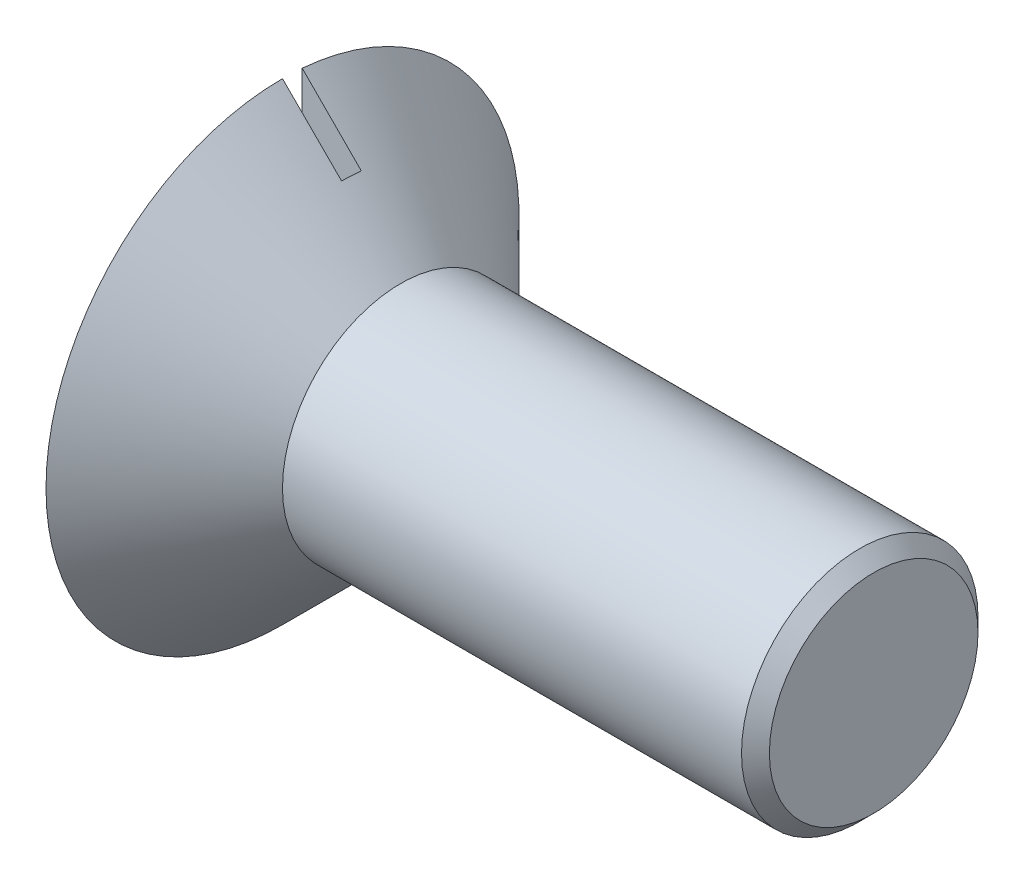
ISO-10303-21;
HEADER;
FILE_DESCRIPTION(('STEP AP214'),'2;1');
FILE_NAME('part.step','',(''),(''),'','','');
FILE_SCHEMA(('AUTOMOTIVE_DESIGN { 1 0 10303 214 1 1 1 1 }'));
ENDSEC;
DATA;
#1=APPLICATION_CONTEXT('core data for automotive mechanical design processes');
#2=APPLICATION_PROTOCOL_DEFINITION('international standard','automotive_design',2000,#1);
#3=PRODUCT_CONTEXT('',#1,'mechanical');
#4=PRODUCT('Part','Part','',(#3));
#5=PRODUCT_RELATED_PRODUCT_CATEGORY('part','',(#4));
#6=PRODUCT_DEFINITION_FORMATION('','',#4);
#7=PRODUCT_DEFINITION_CONTEXT('part definition',#1,'design');
#8=PRODUCT_DEFINITION('design','',#6,#7);
#9=PRODUCT_DEFINITION_SHAPE('','',#8);
#10=(LENGTH_UNIT() NAMED_UNIT(*) SI_UNIT(.MILLI.,.METRE.));
#11=(NAMED_UNIT(*) PLANE_ANGLE_UNIT() SI_UNIT($,.RADIAN.));
#12=(NAMED_UNIT(*) SI_UNIT($,.STERADIAN.) SOLID_ANGLE_UNIT());
#13=UNCERTAINTY_MEASURE_WITH_UNIT(LENGTH_MEASURE(1.E-05),#10,'distance_accuracy_value','');
#14=(GEOMETRIC_REPRESENTATION_CONTEXT(3) GLOBAL_UNCERTAINTY_ASSIGNED_CONTEXT((#13)) GLOBAL_UNIT_ASSIGNED_CONTEXT((#10,
#11,#12)) REPRESENTATION_CONTEXT('',''));
#15=CARTESIAN_POINT('',(0.,0.,0.));
#16=DIRECTION('',(0.,0.,1.));
#17=DIRECTION('',(1.,0.,0.));
#18=AXIS2_PLACEMENT_3D('',#15,#16,#17);
#19=CARTESIAN_POINT('',(4.44145965103185,12.,0.));
#20=DIRECTION('',(1.,0.,0.));
#21=DIRECTION('',(0.,0.,-1.));
#22=AXIS2_PLACEMENT_3D('',#19,#20,#21);
#23=PLANE('',#22);
#24=CARTESIAN_POINT('',(4.44145965103185,0.,0.));
#25=DIRECTION('',(-1.,0.,0.));
#26=DIRECTION('',(0.,0.,1.));
#27=AXIS2_PLACEMENT_3D('',#24,#25,#26);
#28=CIRCLE('',#27,12.);
#29=CARTESIAN_POINT('',(4.44145965103185,11.9581754153506,-1.00101984780733));
#30=VERTEX_POINT('',#29);
#31=CARTESIAN_POINT('',(4.44145965103185,-11.9581754153506,-1.00101984780733));
#32=VERTEX_POINT('',#31);
#33=EDGE_CURVE('E93',#30,#32,#28,.T.);
#34=ORIENTED_EDGE('',*,*,#33,.T.);
#35=DIRECTION('',(0.,1.,0.));
#36=VECTOR('',#35,1.);
#37=CARTESIAN_POINT('',(4.44145965103185,-50.,-1.00101984780733));
#38=LINE('',#37,#36);
#39=EDGE_CURVE('E198',#32,#30,#38,.T.);
#40=ORIENTED_EDGE('',*,*,#39,.T.);
#41=EDGE_LOOP('',(#34,#40));
#42=FACE_BOUND('',#41,.T.);
#43=ADVANCED_FACE('F33',(#42),#23,.F.);
#44=CARTESIAN_POINT('',(34.4414596510318,0.,0.));
#45=DIRECTION('',(-1.,0.,0.));
#46=DIRECTION('',(0.,0.,1.));
#47=AXIS2_PLACEMENT_3D('',#44,#45,#46);
#48=CONICAL_SURFACE('',#47,5.29289321881346,0.785398163397443);
#49=CARTESIAN_POINT('',(33.7343528698453,0.,0.));
#50=DIRECTION('',(-1.,0.,0.));
#51=DIRECTION('',(0.,0.,1.));
#52=AXIS2_PLACEMENT_3D('',#49,#50,#51);
#53=CIRCLE('',#52,6.);
#54=CARTESIAN_POINT('',(33.7343528698453,0.,6.));
#55=VERTEX_POINT('',#54);
#56=EDGE_CURVE('E98',#55,#55,#53,.T.);
#57=ORIENTED_EDGE('',*,*,#56,.F.);
#58=EDGE_LOOP('',(#57));
#59=FACE_BOUND('',#58,.T.);
#60=CARTESIAN_POINT('',(34.4414596510318,0.,0.));
#61=DIRECTION('',(-1.,0.,0.));
#62=DIRECTION('',(0.,0.,1.));
#63=AXIS2_PLACEMENT_3D('',#60,#61,#62);
#64=CIRCLE('',#63,5.29289321881346);
#65=CARTESIAN_POINT('',(34.4414596510318,0.,5.29289321881346));
#66=VERTEX_POINT('',#65);
#67=EDGE_CURVE('E82',#66,#66,#64,.T.);
#68=ORIENTED_EDGE('',*,*,#67,.T.);
#69=EDGE_LOOP('',(#68));
#70=FACE_BOUND('',#69,.T.);
#71=ADVANCED_FACE('F35',(#59,#70),#48,.T.);
#72=CARTESIAN_POINT('',(34.4414596510318,2.78857511208858,0.));
#73=DIRECTION('',(-1.,0.,0.));
#74=DIRECTION('',(0.,0.,1.));
#75=AXIS2_PLACEMENT_3D('',#72,#73,#74);
#76=PLANE('',#75);
#77=ORIENTED_EDGE('',*,*,#67,.F.);
#78=EDGE_LOOP('',(#77));
#79=FACE_BOUND('',#78,.T.);
#80=ADVANCED_FACE('F135',(#79),#76,.F.);
#81=CARTESIAN_POINT('',(4.44145965103185,-12.,0.));
#82=VERTEX_POINT('',#81);
#83=CARTESIAN_POINT('',(4.44145965103185,12.,0.));
#84=VERTEX_POINT('',#83);
#85=EDGE_CURVE('E87',#82,#84,#28,.T.);
#86=ORIENTED_EDGE('',*,*,#85,.T.);
#87=DIRECTION('',(0.,1.,0.));
#88=VECTOR('',#87,1.);
#89=CARTESIAN_POINT('',(4.44145965103185,-50.,0.));
#90=LINE('',#89,#88);
#91=EDGE_CURVE('E76',#82,#84,#90,.T.);
#92=ORIENTED_EDGE('',*,*,#91,.F.);
#93=EDGE_LOOP('',(#86,#92));
#94=FACE_BOUND('',#93,.T.);
#95=ADVANCED_FACE('F86',(#94),#23,.F.);
#96=CARTESIAN_POINT('',(10.4414596510319,0.,0.));
#97=DIRECTION('',(-1.,0.,0.));
#98=DIRECTION('',(0.,0.,1.));
#99=AXIS2_PLACEMENT_3D('',#96,#97,#98);
#100=CONICAL_SURFACE('',#99,6.,0.785398163397448);
#101=ORIENTED_EDGE('',*,*,#33,.F.);
#102=CARTESIAN_POINT('',(-10.0708042959055,26.493359523782,-1.00101984780733));
#103=CARTESIAN_POINT('',(-9.15259849290721,25.5744931995026,-1.00101984780733));
#104=CARTESIAN_POINT('',(-8.23442172282823,24.6555978565731,-1.00101984780733));
#105=CARTESIAN_POINT('',(-6.3981622073766,22.8177092167016,-1.00101984780733));
#106=CARTESIAN_POINT('',(-5.48007946221386,21.89871591955,-1.00101984780733));
#107=CARTESIAN_POINT('',(-3.64400176743646,20.0605492161531,-1.00101984780733));
#108=CARTESIAN_POINT('',(-2.72600682456594,19.1413758031711,-1.00101984780733));
#109=CARTESIAN_POINT('',(-0.890224394381077,17.3028257357959,-1.00101984780733));
#110=CARTESIAN_POINT('',(0.0275630933705793,16.3834490818394,-1.00101984780733));
#111=CARTESIAN_POINT('',(1.85598356354076,14.5512068959669,-1.00101984780733));
#112=CARTESIAN_POINT('',(2.76661898498205,13.6383437984992,-1.00101984780733));
#113=CARTESIAN_POINT('',(4.13213413707899,12.268606517198,-1.00101984780733));
#114=CARTESIAN_POINT('',(4.5872343497143,11.8119521524256,-1.00101984780733));
#115=CARTESIAN_POINT('',(5.49722419846357,10.8984342336236,-1.00101984780733));
#116=CARTESIAN_POINT('',(5.95211383471335,10.4415706797292,-1.00101984780733));
#117=CARTESIAN_POINT('',(6.86157327402951,9.52755343440541,-1.00101984780733));
#118=CARTESIAN_POINT('',(7.31614308657204,9.07039975240763,-1.00101984780733));
#119=CARTESIAN_POINT('',(8.22480787135532,8.15561844990177,-1.00101984780733));
#120=CARTESIAN_POINT('',(8.67890284241652,7.69799082822198,-1.00101984780733));
#121=CARTESIAN_POINT('',(9.58630868190657,6.78196834748077,-1.00101984780733));
#122=CARTESIAN_POINT('',(10.039619559266,6.32357349727639,-1.00101984780733));
#123=CARTESIAN_POINT('',(10.7184750464512,5.63488776838287,-1.00101984780733));
#124=CARTESIAN_POINT('',(10.9445746174529,5.40514407927624,-1.00101984780733));
#125=CARTESIAN_POINT('',(11.3962297752309,4.94512276847933,-1.00101984780733));
#126=CARTESIAN_POINT('',(11.6217853628012,4.71484514756946,-1.00101984780733));
#127=CARTESIAN_POINT('',(11.9705535682677,4.35748922337195,-1.00101984780733));
#128=CARTESIAN_POINT('',(12.0940565651549,4.23069439285403,-1.00101984780733));
#129=CARTESIAN_POINT('',(12.340734065413,3.97678482481711,-1.00101984780733));
#130=CARTESIAN_POINT('',(12.4639085678889,3.8496700864285,-1.00101984780733));
#131=CARTESIAN_POINT('',(12.7099512008387,3.59488738763081,-1.00101984780733));
#132=CARTESIAN_POINT('',(12.8328188772638,3.46721898823348,-1.00101984780733));
#133=CARTESIAN_POINT('',(13.0779513219767,3.21130631079086,-1.00101984780733));
#134=CARTESIAN_POINT('',(13.2002160937921,3.08306203612346,-1.00101984780733));
#135=CARTESIAN_POINT('',(13.4852376069845,2.78214439884606,-1.00101984780733));
#136=CARTESIAN_POINT('',(13.6476626358327,2.60915525751065,-1.00101984780733));
#137=CARTESIAN_POINT('',(13.8891769164194,2.34801609226837,-1.00101984780733));
#138=CARTESIAN_POINT('',(13.9692513281359,2.26077901971225,-1.00101984780733));
#139=CARTESIAN_POINT('',(14.1284759428262,2.08547221926703,-1.00101984780733));
#140=CARTESIAN_POINT('',(14.2076261804312,1.99740252280371,-1.00101984780733));
#141=CARTESIAN_POINT('',(14.3912163934214,1.79012655098334,-1.00101984780733));
#142=CARTESIAN_POINT('',(14.4951516756805,1.6704677981589,-1.00101984780733));
#143=CARTESIAN_POINT('',(14.6483216963588,1.48807823746929,-1.00101984780733));
#144=CARTESIAN_POINT('',(14.6990647894482,1.42661723656664,-1.00101984780733));
#145=CARTESIAN_POINT('',(14.7991146094415,1.30254037505422,-1.00101984780733));
#146=CARTESIAN_POINT('',(14.8484214732184,1.23992462542724,-1.00101984780733));
#147=CARTESIAN_POINT('',(14.9455739462217,1.11236960765884,-1.00101984780733));
#148=CARTESIAN_POINT('',(14.993394974852,1.0474114909558,-1.00101984780733));
#149=CARTESIAN_POINT('',(15.0859673546928,0.915180870929621,-1.00101984780733));
#150=CARTESIAN_POINT('',(15.1307145851416,0.847905435547611,-1.00101984780733));
#151=CARTESIAN_POINT('',(15.2149113239307,0.710842376096654,-1.00101984780733));
#152=CARTESIAN_POINT('',(15.2544017434175,0.64108025587845,-1.00101984780733));
#153=CARTESIAN_POINT('',(15.325317650253,0.497588707964032,-1.00101984780733));
#154=CARTESIAN_POINT('',(15.3567672887123,0.423871984850606,-1.00101984780733));
#155=CARTESIAN_POINT('',(15.3930477694336,0.313354559752072,-1.00101984780733));
#156=CARTESIAN_POINT('',(15.4030560893192,0.278264541678551,-1.00101984780733));
#157=CARTESIAN_POINT('',(15.4197822411924,0.207297675915694,-1.00101984780733));
#158=CARTESIAN_POINT('',(15.4265006297511,0.17142096238855,-1.00101984780733));
#159=CARTESIAN_POINT('',(15.4361480691584,0.0993749714305139,-1.00101984780733));
#160=CARTESIAN_POINT('',(15.4391000839714,0.0632088331381312,-1.00101984780733));
#161=CARTESIAN_POINT('',(15.4410520243538,-0.00923208328132189,-1.00101984780733));
#162=CARTESIAN_POINT('',(15.4400520293825,-0.0455068592094696,-1.00101984780733));
#163=CARTESIAN_POINT('',(15.434193368811,-0.117612470961061,-1.00101984780733));
#164=CARTESIAN_POINT('',(15.4293477435862,-0.153444392197453,-1.00101984780733));
#165=CARTESIAN_POINT('',(15.416176350608,-0.224466036741467,-1.00101984780733));
#166=CARTESIAN_POINT('',(15.4078489874769,-0.259655457922812,-1.00101984780733));
#167=CARTESIAN_POINT('',(15.388157346096,-0.329448000324558,-1.00101984780733));
#168=CARTESIAN_POINT('',(15.3767705235482,-0.36404465440203,-1.00101984780733));
#169=CARTESIAN_POINT('',(15.3515388289308,-0.432310225608327,-1.00101984780733));
#170=CARTESIAN_POINT('',(15.3376942815334,-0.465979264599769,-1.00101984780733));
#171=CARTESIAN_POINT('',(15.2977784265859,-0.555433263164619,-1.00101984780733));
#172=CARTESIAN_POINT('',(15.2698765204078,-0.610397204677973,-1.00101984780733));
#173=CARTESIAN_POINT('',(15.2102503896822,-0.718229281263564,-1.00101984780733));
#174=CARTESIAN_POINT('',(15.1785220867413,-0.771095098858051,-1.00101984780733));
#175=CARTESIAN_POINT('',(15.1123277744072,-0.875313430307049,-1.00101984780733));
#176=CARTESIAN_POINT('',(15.0778530845859,-0.926660380797087,-1.00101984780733));
#177=CARTESIAN_POINT('',(15.0070250632142,-1.02804454819312,-1.00101984780733));
#178=CARTESIAN_POINT('',(14.970671370408,-1.07808151043497,-1.00101984780733));
#179=CARTESIAN_POINT('',(14.8962785003644,-1.17755780576895,-1.00101984780733));
#180=CARTESIAN_POINT('',(14.8582274644429,-1.22698822642294,-1.00101984780733));
#181=CARTESIAN_POINT('',(14.7810854716933,-1.32503436641685,-1.00101984780733));
#182=CARTESIAN_POINT('',(14.7419944266338,-1.37365001606012,-1.00101984780733));
#183=CARTESIAN_POINT('',(14.6631111344943,-1.47011957366132,-1.00101984780733));
#184=CARTESIAN_POINT('',(14.623320721707,-1.51797498542878,-1.00101984780733));
#185=CARTESIAN_POINT('',(14.5431238644728,-1.61316240721316,-1.00101984780733));
#186=CARTESIAN_POINT('',(14.5027174446379,-1.66049443801146,-1.00101984780733));
#187=CARTESIAN_POINT('',(14.3825454602959,-1.79979836280856,-1.00101984780733));
#188=CARTESIAN_POINT('',(14.3020911787254,-1.89117572892698,-1.00101984780733));
#189=CARTESIAN_POINT('',(14.1399424612432,-2.07282509362041,-1.00101984780733));
#190=CARTESIAN_POINT('',(14.0582479688588,-2.16309704152032,-1.00101984780733));
#191=CARTESIAN_POINT('',(13.8939749874898,-2.34285496786248,-1.00101984780733));
#192=CARTESIAN_POINT('',(13.8113963772792,-2.43234083537781,-1.00101984780733));
#193=CARTESIAN_POINT('',(13.645601195787,-2.61072010678553,-1.00101984780733));
#194=CARTESIAN_POINT('',(13.5623846186901,-2.69961350526346,-1.00101984780733));
#195=CARTESIAN_POINT('',(13.3118287948195,-2.96583624118227,-1.00101984780733));
#196=CARTESIAN_POINT('',(13.1437787322939,-3.14249614747671,-1.00101984780733));
#197=CARTESIAN_POINT('',(12.8065583506333,-3.49471209777072,-1.00101984780733));
#198=CARTESIAN_POINT('',(12.6373881247263,-3.67026823132099,-1.00101984780733));
#199=CARTESIAN_POINT('',(12.2996498267065,-4.01926151020227,-1.00101984780733));
#200=CARTESIAN_POINT('',(12.1310876850226,-4.19270439764971,-1.00101984780733));
#201=CARTESIAN_POINT('',(11.7934526012238,-4.53909906144287,-1.00101984780733));
#202=CARTESIAN_POINT('',(11.6243796482792,-4.7120508272234,-1.00101984780733));
#203=CARTESIAN_POINT('',(11.2859530755377,-5.05751006972109,-1.00101984780733));
#204=CARTESIAN_POINT('',(11.1165996382391,-5.2300177252824,-1.00101984780733));
#205=CARTESIAN_POINT('',(10.7776219552662,-5.57476428951998,-1.00101984780733));
#206=CARTESIAN_POINT('',(10.6079977115008,-5.74700320007383,-1.00101984780733));
#207=CARTESIAN_POINT('',(10.0983756117639,-6.26386562123856,-1.00101984780733));
#208=CARTESIAN_POINT('',(9.75806957677303,-6.60818522812616,-1.00101984780733));
#209=CARTESIAN_POINT('',(9.07694994120208,-7.29632214901531,-1.00101984780733));
#210=CARTESIAN_POINT('',(8.73613634028612,-7.64013946268421,-1.00101984780733));
#211=CARTESIAN_POINT('',(7.71319603183889,-8.67110143148449,-1.00101984780733));
#212=CARTESIAN_POINT('',(7.03057267893705,-9.35775322051808,-1.00101984780733));
#213=CARTESIAN_POINT('',(5.66454228256945,-10.7305339410434,-1.00101984780733));
#214=CARTESIAN_POINT('',(4.98113511563113,-11.4166627495753,-1.00101984780733));
#215=CARTESIAN_POINT('',(3.61393425494085,-12.7885327950165,-1.00101984780733));
#216=CARTESIAN_POINT('',(2.93014056185964,-13.4742740325943,-1.00101984780733));
#217=CARTESIAN_POINT('',(1.56061026149215,-14.8472207727206,-1.00101984780733));
#218=CARTESIAN_POINT('',(0.874873052183712,-15.534425674635,-1.00101984780733));
#219=CARTESIAN_POINT('',(-0.496765352946225,-16.9086724263849,-1.00101984780733));
#220=CARTESIAN_POINT('',(-1.18266654884264,-17.5957142761456,-1.00101984780733));
#221=CARTESIAN_POINT('',(-3.24047657697101,-19.6566092983594,-1.00101984780733));
#222=CARTESIAN_POINT('',(-4.61255394955406,-21.0302941774599,-1.00101984780733));
#223=CARTESIAN_POINT('',(-6.32539112243215,-22.7448382556024,-1.00101984780733));
#224=CARTESIAN_POINT('',(-6.66603824306798,-23.0858100424631,-1.00101984780733));
#225=CARTESIAN_POINT('',(-7.34734875680305,-23.7677424570235,-1.00101984780733));
#226=CARTESIAN_POINT('',(-7.68801215000498,-24.1087030846205,-1.00101984780733));
#227=CARTESIAN_POINT('',(-8.36902556922376,-24.7902869898859,-1.00101984780733));
#228=CARTESIAN_POINT('',(-8.70937558392362,-25.130910278862,-1.00101984780733));
#229=CARTESIAN_POINT('',(-9.39008361969228,-25.8121437634074,-1.00101984780733));
#230=CARTESIAN_POINT('',(-9.73044164068212,-26.1527539590556,-1.00101984780733));
#231=CARTESIAN_POINT('',(-10.0708042959055,-26.493359523782,-1.00101984780733));
#232=B_SPLINE_CURVE_WITH_KNOTS('',3,(#102,#103,#104,#105,#106,#107,#108,#109,#110,#111,#112,
#113,#114,#115,#116,#117,#118,#119,#120,#121,#122,#123,#124,#125,#126,#127,#128,#129,#130,#131,
#132,#133,#134,#135,#136,#137,#138,#139,#140,#141,#142,#143,#144,#145,#146,#147,#148,#149,#150,
#151,#152,#153,#154,#155,#156,#157,#158,#159,#160,#161,#162,#163,#164,#165,#166,#167,#168,#169,
#170,#171,#172,#173,#174,#175,#176,#177,#178,#179,#180,#181,#182,#183,#184,#185,#186,#187,#188,
#189,#190,#191,#192,#193,#194,#195,#196,#197,#198,#199,#200,#201,#202,#203,#204,#205,#206,#207,
#208,#209,#210,#211,#212,#213,#214,#215,#216,#217,#218,#219,#220,#221,#222,#223,#224,#225,#226,
#227,#228,#229,#230,#231),.UNSPECIFIED.,.F.,.F.,(4,2,2,2,2,2,2,2,2,2,2,2,2,2,2,2,2,2,2,2,2,2,2,
2,2,2,2,2,2,2,2,2,2,2,2,2,2,2,2,2,2,2,2,2,2,2,2,2,2,2,2,2,2,2,2,2,2,2,2,2,2,2,2,2,4),(0.,
3.89701873414366,7.79404598698147,11.6912693726677,15.5884844648998,19.4567116778056,
21.3908379716307,23.3249630162241,25.2590281130859,27.1930980029942,29.1271457175384,
30.0941656881932,31.0611842463365,31.592191582295,32.123200363252,32.6547634645964,
33.1863234520377,33.8981787545729,34.2534194745944,34.6086468398533,35.0840691474607,
35.323158993396,35.5622259789648,35.8041568265108,36.0464059223377,36.2866431438681,
36.5261500850312,36.6354894781906,36.7448103675597,36.8534614802369,36.9621104083848,
37.0703924785572,37.1787242194551,37.2878772244378,37.3970158207304,37.5816887754651,
37.7665603343784,37.9520413492439,38.1375581581704,38.3246795677289,38.511816903044,
38.6985206946538,38.885217046186,39.2504430961016,39.6156858266713,39.9809792958164,
40.3462760987456,41.0777342811946,41.8091323331015,42.5347068209102,43.2602968010712,
43.9855241532054,44.7107464156369,46.1630806541385,47.6154158540478,50.5200984605932,
53.4253286109173,56.330553735042,59.2430054007503,62.1554583995591,67.9801006455861,
69.4260328653966,70.8719759041971,72.3165385428468,73.7610903729639),.UNSPECIFIED.);
#233=CARTESIAN_POINT('',(7.44145965103185,8.94415782867766,-1.00101984780733));
#234=VERTEX_POINT('',#233);
#235=EDGE_CURVE('E11',#30,#234,#232,.T.);
#236=ORIENTED_EDGE('',*,*,#235,.T.);
#237=CARTESIAN_POINT('',(7.44145965103185,0.,0.));
#238=DIRECTION('',(1.,0.,0.));
#239=DIRECTION('',(0.,0.,-1.));
#240=AXIS2_PLACEMENT_3D('',#237,#238,#239);
#241=CIRCLE('',#240,9.);
#242=CARTESIAN_POINT('',(7.44145965103185,9.,0.));
#243=VERTEX_POINT('',#242);
#244=EDGE_CURVE('E42',#234,#243,#241,.T.);
#245=ORIENTED_EDGE('',*,*,#244,.T.);
#246=DIRECTION('',(-0.707106781186548,0.707106781186547,0.));
#247=VECTOR('',#246,1.);
#248=CARTESIAN_POINT('',(16.4414596510319,0.,0.));
#249=LINE('',#248,#247);
#250=EDGE_CURVE('E37',#243,#84,#249,.T.);
#251=ORIENTED_EDGE('',*,*,#250,.T.);
#252=ORIENTED_EDGE('',*,*,#85,.F.);
#253=DIRECTION('',(0.707106781186548,0.707106781186547,0.));
#254=VECTOR('',#253,1.);
#255=CARTESIAN_POINT('',(16.4414596510319,0.,0.));
#256=LINE('',#255,#254);
#257=CARTESIAN_POINT('',(7.44145965103185,-9.,0.));
#258=VERTEX_POINT('',#257);
#259=EDGE_CURVE('E73',#82,#258,#256,.T.);
#260=ORIENTED_EDGE('',*,*,#259,.T.);
#261=CARTESIAN_POINT('',(7.44145965103185,-8.94415782867766,-1.00101984780733));
#262=VERTEX_POINT('',#261);
#263=EDGE_CURVE('E81',#258,#262,#241,.T.);
#264=ORIENTED_EDGE('',*,*,#263,.T.);
#265=EDGE_CURVE('E43',#262,#32,#232,.T.);
#266=ORIENTED_EDGE('',*,*,#265,.T.);
#267=EDGE_LOOP('',(#101,#236,#245,#251,#252,#260,#264,#266));
#268=FACE_BOUND('',#267,.T.);
#269=CARTESIAN_POINT('',(10.4414596510319,0.,0.));
#270=DIRECTION('',(-1.,0.,0.));
#271=DIRECTION('',(0.,0.,1.));
#272=AXIS2_PLACEMENT_3D('',#269,#270,#271);
#273=CIRCLE('',#272,6.);
#274=CARTESIAN_POINT('',(10.4414596510319,0.,6.));
#275=VERTEX_POINT('',#274);
#276=EDGE_CURVE('E94',#275,#275,#273,.T.);
#277=ORIENTED_EDGE('',*,*,#276,.T.);
#278=EDGE_LOOP('',(#277));
#279=FACE_BOUND('',#278,.T.);
#280=ADVANCED_FACE('F90',(#268,#279),#100,.T.);
#281=CARTESIAN_POINT('',(-22.0003252628631,0.,0.));
#282=DIRECTION('',(-1.,0.,0.));
#283=DIRECTION('',(0.,0.,1.));
#284=AXIS2_PLACEMENT_3D('',#281,#282,#283);
#285=CYLINDRICAL_SURFACE('',#284,6.);
#286=ORIENTED_EDGE('',*,*,#276,.F.);
#287=EDGE_LOOP('',(#286));
#288=FACE_BOUND('',#287,.T.);
#289=ORIENTED_EDGE('',*,*,#56,.T.);
#290=EDGE_LOOP('',(#289));
#291=FACE_BOUND('',#290,.T.);
#292=ADVANCED_FACE('F118',(#288,#291),#285,.T.);
#293=CARTESIAN_POINT('',(4.44145965103185,-50.,-1.00101984780733));
#294=DIRECTION('',(0.,0.,-1.));
#295=DIRECTION('',(-1.,0.,0.));
#296=AXIS2_PLACEMENT_3D('',#293,#294,#295);
#297=PLANE('',#296);
#298=ORIENTED_EDGE('',*,*,#39,.F.);
#299=ORIENTED_EDGE('',*,*,#265,.F.);
#300=DIRECTION('',(0.,1.,0.));
#301=VECTOR('',#300,1.);
#302=CARTESIAN_POINT('',(7.44145965103185,-50.,-1.00101984780733));
#303=LINE('',#302,#301);
#304=EDGE_CURVE('E200',#262,#234,#303,.T.);
#305=ORIENTED_EDGE('',*,*,#304,.T.);
#306=ORIENTED_EDGE('',*,*,#235,.F.);
#307=EDGE_LOOP('',(#298,#299,#305,#306));
#308=FACE_BOUND('',#307,.T.);
#309=ADVANCED_FACE('F113',(#308),#297,.F.);
#310=CARTESIAN_POINT('',(7.44145965103185,-50.,-1.00101984780733));
#311=DIRECTION('',(1.,0.,0.));
#312=DIRECTION('',(0.,0.,-1.));
#313=AXIS2_PLACEMENT_3D('',#310,#311,#312);
#314=PLANE('',#313);
#315=ORIENTED_EDGE('',*,*,#304,.F.);
#316=ORIENTED_EDGE('',*,*,#263,.F.);
#317=DIRECTION('',(0.,1.,0.));
#318=VECTOR('',#317,1.);
#319=CARTESIAN_POINT('',(7.44145965103185,-50.,0.));
#320=LINE('',#319,#318);
#321=EDGE_CURVE('E50',#258,#243,#320,.T.);
#322=ORIENTED_EDGE('',*,*,#321,.T.);
#323=ORIENTED_EDGE('',*,*,#244,.F.);
#324=EDGE_LOOP('',(#315,#316,#322,#323));
#325=FACE_BOUND('',#324,.T.);
#326=ADVANCED_FACE('F117',(#325),#314,.F.);
#327=CARTESIAN_POINT('',(7.44145965103185,-50.,0.));
#328=DIRECTION('',(0.,0.,1.));
#329=DIRECTION('',(1.,0.,0.));
#330=AXIS2_PLACEMENT_3D('',#327,#328,#329);
#331=PLANE('',#330);
#332=ORIENTED_EDGE('',*,*,#321,.F.);
#333=ORIENTED_EDGE('',*,*,#259,.F.);
#334=ORIENTED_EDGE('',*,*,#91,.T.);
#335=ORIENTED_EDGE('',*,*,#250,.F.);
#336=EDGE_LOOP('',(#332,#333,#334,#335));
#337=FACE_BOUND('',#336,.T.);
#338=ADVANCED_FACE('F75',(#337),#331,.F.);
#339=CLOSED_SHELL('',(#43,#71,#80,#95,#280,#292,#309,#326,#338));
#340=MANIFOLD_SOLID_BREP('B2',#339);
#341=ADVANCED_BREP_SHAPE_REPRESENTATION('',(#18,#340),#14);
#342=SHAPE_DEFINITION_REPRESENTATION(#9,#341);
ENDSEC;
END-ISO-10303-21;
